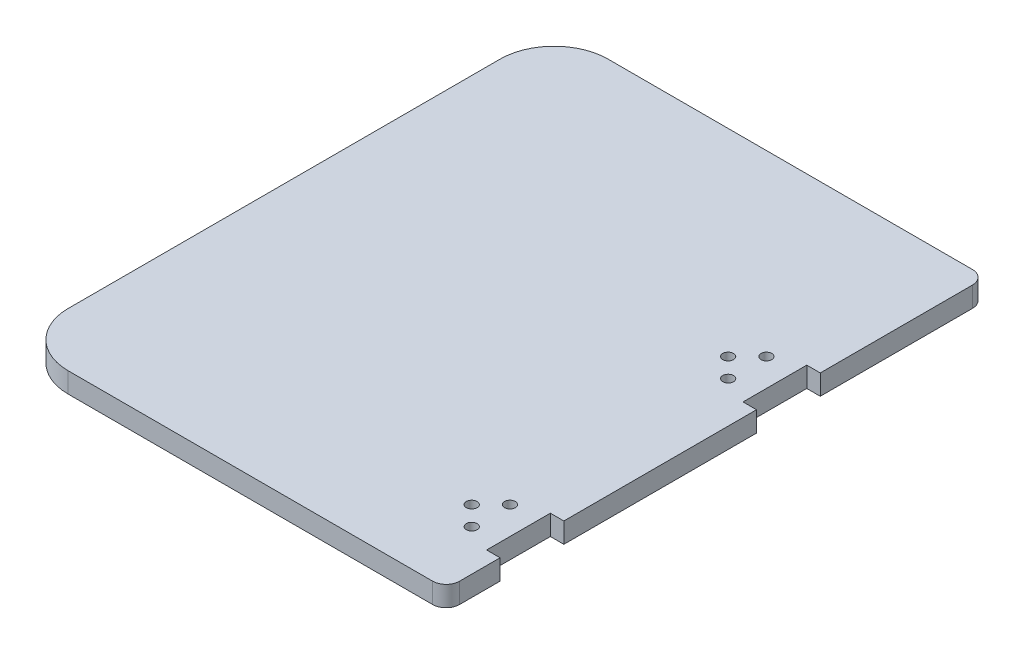
ISO-10303-21;
HEADER;
FILE_DESCRIPTION(('STEP AP214'),'2;1');
FILE_NAME('part.step','',(''),(''),'','','');
FILE_SCHEMA(('AUTOMOTIVE_DESIGN { 1 0 10303 214 1 1 1 1 }'));
ENDSEC;
DATA;
#1=APPLICATION_CONTEXT('core data for automotive mechanical design processes');
#2=APPLICATION_PROTOCOL_DEFINITION('international standard','automotive_design',2000,#1);
#3=PRODUCT_CONTEXT('',#1,'mechanical');
#4=PRODUCT('Part','Part','',(#3));
#5=PRODUCT_RELATED_PRODUCT_CATEGORY('part','',(#4));
#6=PRODUCT_DEFINITION_FORMATION('','',#4);
#7=PRODUCT_DEFINITION_CONTEXT('part definition',#1,'design');
#8=PRODUCT_DEFINITION('design','',#6,#7);
#9=PRODUCT_DEFINITION_SHAPE('','',#8);
#10=(LENGTH_UNIT() NAMED_UNIT(*) SI_UNIT(.MILLI.,.METRE.));
#11=(NAMED_UNIT(*) PLANE_ANGLE_UNIT() SI_UNIT($,.RADIAN.));
#12=(NAMED_UNIT(*) SI_UNIT($,.STERADIAN.) SOLID_ANGLE_UNIT());
#13=UNCERTAINTY_MEASURE_WITH_UNIT(LENGTH_MEASURE(1.E-05),#10,'distance_accuracy_value','');
#14=(GEOMETRIC_REPRESENTATION_CONTEXT(3) GLOBAL_UNCERTAINTY_ASSIGNED_CONTEXT((#13)) GLOBAL_UNIT_ASSIGNED_CONTEXT((#10,
#11,#12)) REPRESENTATION_CONTEXT('',''));
#15=CARTESIAN_POINT('',(0.,0.,0.));
#16=DIRECTION('',(0.,0.,1.));
#17=DIRECTION('',(1.,0.,0.));
#18=AXIS2_PLACEMENT_3D('',#15,#16,#17);
#19=CARTESIAN_POINT('',(203.2,9.525,-6.35000000000004));
#20=DIRECTION('',(-1.,0.,0.));
#21=DIRECTION('',(0.,0.,1.));
#22=AXIS2_PLACEMENT_3D('',#19,#20,#21);
#23=PLANE('',#22);
#24=DIRECTION('',(0.,0.,-1.));
#25=VECTOR('',#24,1.);
#26=CARTESIAN_POINT('',(203.2,9.525,-6.35000000000004));
#27=LINE('',#26,#25);
#28=CARTESIAN_POINT('',(203.2,9.525,-176.05));
#29=VERTEX_POINT('',#28);
#30=CARTESIAN_POINT('',(203.2,9.525,-247.65));
#31=VERTEX_POINT('',#30);
#32=EDGE_CURVE('E234',#29,#31,#27,.T.);
#33=ORIENTED_EDGE('',*,*,#32,.F.);
#34=DIRECTION('',(0.,1.,0.));
#35=VECTOR('',#34,1.);
#36=CARTESIAN_POINT('',(203.2,-0.000999999999999265,-176.05));
#37=LINE('',#36,#35);
#38=CARTESIAN_POINT('',(203.2,0.,-176.05));
#39=VERTEX_POINT('',#38);
#40=EDGE_CURVE('E184',#39,#29,#37,.T.);
#41=ORIENTED_EDGE('',*,*,#40,.F.);
#42=DIRECTION('',(0.,0.,-1.));
#43=VECTOR('',#42,1.);
#44=CARTESIAN_POINT('',(203.2,0.,-6.35000000000004));
#45=LINE('',#44,#43);
#46=CARTESIAN_POINT('',(203.2,0.,-247.65));
#47=VERTEX_POINT('',#46);
#48=EDGE_CURVE('E254',#39,#47,#45,.T.);
#49=ORIENTED_EDGE('',*,*,#48,.T.);
#50=DIRECTION('',(0.,-1.,0.));
#51=VECTOR('',#50,1.);
#52=CARTESIAN_POINT('',(203.2,9.525,-247.65));
#53=LINE('',#52,#51);
#54=EDGE_CURVE('E267',#31,#47,#53,.T.);
#55=ORIENTED_EDGE('',*,*,#54,.F.);
#56=EDGE_LOOP('',(#33,#41,#49,#55));
#57=FACE_BOUND('',#56,.T.);
#58=ADVANCED_FACE('F32',(#57),#23,.F.);
#59=CARTESIAN_POINT('',(203.2,0.,-55.4));
#60=VERTEX_POINT('',#59);
#61=CARTESIAN_POINT('',(203.2,0.,-146.05));
#62=VERTEX_POINT('',#61);
#63=EDGE_CURVE('E259',#60,#62,#45,.T.);
#64=ORIENTED_EDGE('',*,*,#63,.T.);
#65=DIRECTION('',(0.,1.,0.));
#66=VECTOR('',#65,1.);
#67=CARTESIAN_POINT('',(203.2,-0.000999999999999265,-146.05));
#68=LINE('',#67,#66);
#69=CARTESIAN_POINT('',(203.2,9.525,-146.05));
#70=VERTEX_POINT('',#69);
#71=EDGE_CURVE('E47',#62,#70,#68,.T.);
#72=ORIENTED_EDGE('',*,*,#71,.T.);
#73=CARTESIAN_POINT('',(203.2,9.525,-55.4));
#74=VERTEX_POINT('',#73);
#75=EDGE_CURVE('E239',#74,#70,#27,.T.);
#76=ORIENTED_EDGE('',*,*,#75,.F.);
#77=DIRECTION('',(0.,1.,0.));
#78=VECTOR('',#77,1.);
#79=CARTESIAN_POINT('',(203.2,-0.000999999999999265,-55.4));
#80=LINE('',#79,#78);
#81=EDGE_CURVE('E216',#60,#74,#80,.T.);
#82=ORIENTED_EDGE('',*,*,#81,.F.);
#83=EDGE_LOOP('',(#64,#72,#76,#82));
#84=FACE_BOUND('',#83,.T.);
#85=ADVANCED_FACE('F324',(#84),#23,.F.);
#86=CARTESIAN_POINT('',(25.4,9.525,-228.6));
#87=DIRECTION('',(0.,-1.,0.));
#88=DIRECTION('',(0.,0.,-1.));
#89=AXIS2_PLACEMENT_3D('',#86,#87,#88);
#90=CYLINDRICAL_SURFACE('',#89,25.4);
#91=CARTESIAN_POINT('',(25.4,0.,-228.6));
#92=DIRECTION('',(0.,1.,0.));
#93=DIRECTION('',(0.,0.,1.));
#94=AXIS2_PLACEMENT_3D('',#91,#92,#93);
#95=CIRCLE('',#94,25.4);
#96=CARTESIAN_POINT('',(25.4000000000002,0.,-254.));
#97=VERTEX_POINT('',#96);
#98=CARTESIAN_POINT('',(0.,0.,-228.6));
#99=VERTEX_POINT('',#98);
#100=EDGE_CURVE('E221',#97,#99,#95,.T.);
#101=ORIENTED_EDGE('',*,*,#100,.T.);
#102=DIRECTION('',(0.,-1.,0.));
#103=VECTOR('',#102,1.);
#104=CARTESIAN_POINT('',(0.,9.525,-228.6));
#105=LINE('',#104,#103);
#106=CARTESIAN_POINT('',(0.,9.525,-228.6));
#107=VERTEX_POINT('',#106);
#108=EDGE_CURVE('E11',#107,#99,#105,.T.);
#109=ORIENTED_EDGE('',*,*,#108,.F.);
#110=CARTESIAN_POINT('',(25.4,9.525,-228.6));
#111=DIRECTION('',(0.,1.,0.));
#112=DIRECTION('',(0.,0.,1.));
#113=AXIS2_PLACEMENT_3D('',#110,#111,#112);
#114=CIRCLE('',#113,25.4);
#115=CARTESIAN_POINT('',(25.4000000000002,9.525,-254.));
#116=VERTEX_POINT('',#115);
#117=EDGE_CURVE('E222',#116,#107,#114,.T.);
#118=ORIENTED_EDGE('',*,*,#117,.F.);
#119=DIRECTION('',(0.,-1.,0.));
#120=VECTOR('',#119,1.);
#121=CARTESIAN_POINT('',(25.4000000000002,9.525,-254.));
#122=LINE('',#121,#120);
#123=EDGE_CURVE('E243',#116,#97,#122,.T.);
#124=ORIENTED_EDGE('',*,*,#123,.T.);
#125=EDGE_LOOP('',(#101,#109,#118,#124));
#126=FACE_BOUND('',#125,.T.);
#127=ADVANCED_FACE('F34',(#126),#90,.T.);
#128=CARTESIAN_POINT('',(0.,9.525,-25.4000000000002));
#129=DIRECTION('',(1.,0.,0.));
#130=DIRECTION('',(0.,0.,-1.));
#131=AXIS2_PLACEMENT_3D('',#128,#129,#130);
#132=PLANE('',#131);
#133=DIRECTION('',(0.,0.,1.));
#134=VECTOR('',#133,1.);
#135=CARTESIAN_POINT('',(0.,0.,-25.4000000000002));
#136=LINE('',#135,#134);
#137=CARTESIAN_POINT('',(0.,0.,-25.4000000000002));
#138=VERTEX_POINT('',#137);
#139=EDGE_CURVE('E246',#99,#138,#136,.T.);
#140=ORIENTED_EDGE('',*,*,#139,.T.);
#141=DIRECTION('',(0.,-1.,0.));
#142=VECTOR('',#141,1.);
#143=CARTESIAN_POINT('',(0.,9.525,-25.4000000000002));
#144=LINE('',#143,#142);
#145=CARTESIAN_POINT('',(0.,9.525,-25.4000000000002));
#146=VERTEX_POINT('',#145);
#147=EDGE_CURVE('E40',#146,#138,#144,.T.);
#148=ORIENTED_EDGE('',*,*,#147,.F.);
#149=DIRECTION('',(0.,0.,1.));
#150=VECTOR('',#149,1.);
#151=CARTESIAN_POINT('',(0.,9.525,-25.4000000000002));
#152=LINE('',#151,#150);
#153=EDGE_CURVE('E225',#107,#146,#152,.T.);
#154=ORIENTED_EDGE('',*,*,#153,.F.);
#155=ORIENTED_EDGE('',*,*,#108,.T.);
#156=EDGE_LOOP('',(#140,#148,#154,#155));
#157=FACE_BOUND('',#156,.T.);
#158=ADVANCED_FACE('F306',(#157),#132,.F.);
#159=CARTESIAN_POINT('',(25.4,9.525,-25.4));
#160=DIRECTION('',(0.,-1.,0.));
#161=DIRECTION('',(0.,0.,-1.));
#162=AXIS2_PLACEMENT_3D('',#159,#160,#161);
#163=CYLINDRICAL_SURFACE('',#162,25.4);
#164=CARTESIAN_POINT('',(25.4,0.,-25.4));
#165=DIRECTION('',(0.,1.,0.));
#166=DIRECTION('',(0.,0.,-1.));
#167=AXIS2_PLACEMENT_3D('',#164,#165,#166);
#168=CIRCLE('',#167,25.4);
#169=CARTESIAN_POINT('',(25.4000000000002,0.,0.));
#170=VERTEX_POINT('',#169);
#171=EDGE_CURVE('E248',#138,#170,#168,.T.);
#172=ORIENTED_EDGE('',*,*,#171,.T.);
#173=DIRECTION('',(0.,-1.,0.));
#174=VECTOR('',#173,1.);
#175=CARTESIAN_POINT('',(25.4000000000002,9.525,0.));
#176=LINE('',#175,#174);
#177=CARTESIAN_POINT('',(25.4000000000002,9.525,0.));
#178=VERTEX_POINT('',#177);
#179=EDGE_CURVE('E276',#178,#170,#176,.T.);
#180=ORIENTED_EDGE('',*,*,#179,.F.);
#181=CARTESIAN_POINT('',(25.4,9.525,-25.4));
#182=DIRECTION('',(0.,1.,0.));
#183=DIRECTION('',(0.,0.,-1.));
#184=AXIS2_PLACEMENT_3D('',#181,#182,#183);
#185=CIRCLE('',#184,25.4);
#186=EDGE_CURVE('E228',#146,#178,#185,.T.);
#187=ORIENTED_EDGE('',*,*,#186,.F.);
#188=ORIENTED_EDGE('',*,*,#147,.T.);
#189=EDGE_LOOP('',(#172,#180,#187,#188));
#190=FACE_BOUND('',#189,.T.);
#191=ADVANCED_FACE('F283',(#190),#163,.T.);
#192=CARTESIAN_POINT('',(25.4000000000002,9.525,0.));
#193=DIRECTION('',(0.,0.,-1.));
#194=DIRECTION('',(-1.,0.,0.));
#195=AXIS2_PLACEMENT_3D('',#192,#193,#194);
#196=PLANE('',#195);
#197=DIRECTION('',(1.,0.,0.));
#198=VECTOR('',#197,1.);
#199=CARTESIAN_POINT('',(25.4000000000002,0.,0.));
#200=LINE('',#199,#198);
#201=CARTESIAN_POINT('',(196.85,0.,0.));
#202=VERTEX_POINT('',#201);
#203=EDGE_CURVE('E250',#170,#202,#200,.T.);
#204=ORIENTED_EDGE('',*,*,#203,.T.);
#205=DIRECTION('',(0.,-1.,0.));
#206=VECTOR('',#205,1.);
#207=CARTESIAN_POINT('',(196.85,9.525,0.));
#208=LINE('',#207,#206);
#209=CARTESIAN_POINT('',(196.85,9.525,0.));
#210=VERTEX_POINT('',#209);
#211=EDGE_CURVE('E273',#210,#202,#208,.T.);
#212=ORIENTED_EDGE('',*,*,#211,.F.);
#213=DIRECTION('',(1.,0.,0.));
#214=VECTOR('',#213,1.);
#215=CARTESIAN_POINT('',(25.4000000000002,9.525,0.));
#216=LINE('',#215,#214);
#217=EDGE_CURVE('E230',#178,#210,#216,.T.);
#218=ORIENTED_EDGE('',*,*,#217,.F.);
#219=ORIENTED_EDGE('',*,*,#179,.T.);
#220=EDGE_LOOP('',(#204,#212,#218,#219));
#221=FACE_BOUND('',#220,.T.);
#222=ADVANCED_FACE('F292',(#221),#196,.F.);
#223=CARTESIAN_POINT('',(196.85,9.525,-6.35));
#224=DIRECTION('',(0.,-1.,0.));
#225=DIRECTION('',(0.,0.,-1.));
#226=AXIS2_PLACEMENT_3D('',#223,#224,#225);
#227=CYLINDRICAL_SURFACE('',#226,6.35);
#228=CARTESIAN_POINT('',(196.85,0.,-6.35));
#229=DIRECTION('',(0.,1.,0.));
#230=DIRECTION('',(0.,0.,1.));
#231=AXIS2_PLACEMENT_3D('',#228,#229,#230);
#232=CIRCLE('',#231,6.35);
#233=CARTESIAN_POINT('',(203.2,0.,-6.35000000000004));
#234=VERTEX_POINT('',#233);
#235=EDGE_CURVE('E252',#202,#234,#232,.T.);
#236=ORIENTED_EDGE('',*,*,#235,.T.);
#237=DIRECTION('',(0.,-1.,0.));
#238=VECTOR('',#237,1.);
#239=CARTESIAN_POINT('',(203.2,9.525,-6.35000000000004));
#240=LINE('',#239,#238);
#241=CARTESIAN_POINT('',(203.2,9.525,-6.35000000000004));
#242=VERTEX_POINT('',#241);
#243=EDGE_CURVE('E270',#242,#234,#240,.T.);
#244=ORIENTED_EDGE('',*,*,#243,.F.);
#245=CARTESIAN_POINT('',(196.85,9.525,-6.35));
#246=DIRECTION('',(0.,1.,0.));
#247=DIRECTION('',(0.,0.,1.));
#248=AXIS2_PLACEMENT_3D('',#245,#246,#247);
#249=CIRCLE('',#248,6.35);
#250=EDGE_CURVE('E232',#210,#242,#249,.T.);
#251=ORIENTED_EDGE('',*,*,#250,.F.);
#252=ORIENTED_EDGE('',*,*,#211,.T.);
#253=EDGE_LOOP('',(#236,#244,#251,#252));
#254=FACE_BOUND('',#253,.T.);
#255=ADVANCED_FACE('F296',(#254),#227,.T.);
#256=CARTESIAN_POINT('',(203.2,0.,-25.4));
#257=VERTEX_POINT('',#256);
#258=EDGE_CURVE('E255',#234,#257,#45,.T.);
#259=ORIENTED_EDGE('',*,*,#258,.T.);
#260=DIRECTION('',(0.,1.,0.));
#261=VECTOR('',#260,1.);
#262=CARTESIAN_POINT('',(203.2,-0.000999999999999265,-25.4));
#263=LINE('',#262,#261);
#264=CARTESIAN_POINT('',(203.2,9.525,-25.4));
#265=VERTEX_POINT('',#264);
#266=EDGE_CURVE('E55',#257,#265,#263,.T.);
#267=ORIENTED_EDGE('',*,*,#266,.T.);
#268=EDGE_CURVE('E235',#242,#265,#27,.T.);
#269=ORIENTED_EDGE('',*,*,#268,.F.);
#270=ORIENTED_EDGE('',*,*,#243,.T.);
#271=EDGE_LOOP('',(#259,#267,#269,#270));
#272=FACE_BOUND('',#271,.T.);
#273=ADVANCED_FACE('F337',(#272),#23,.F.);
#274=CARTESIAN_POINT('',(196.85,9.525,-247.65));
#275=DIRECTION('',(0.,-1.,0.));
#276=DIRECTION('',(0.,0.,-1.));
#277=AXIS2_PLACEMENT_3D('',#274,#275,#276);
#278=CYLINDRICAL_SURFACE('',#277,6.34999999999999);
#279=CARTESIAN_POINT('',(196.85,0.,-247.65));
#280=DIRECTION('',(0.,1.,0.));
#281=DIRECTION('',(0.,0.,1.));
#282=AXIS2_PLACEMENT_3D('',#279,#280,#281);
#283=CIRCLE('',#282,6.34999999999999);
#284=CARTESIAN_POINT('',(196.85,0.,-254.));
#285=VERTEX_POINT('',#284);
#286=EDGE_CURVE('E258',#47,#285,#283,.T.);
#287=ORIENTED_EDGE('',*,*,#286,.T.);
#288=DIRECTION('',(0.,-1.,0.));
#289=VECTOR('',#288,1.);
#290=CARTESIAN_POINT('',(196.85,9.525,-254.));
#291=LINE('',#290,#289);
#292=CARTESIAN_POINT('',(196.85,9.525,-254.));
#293=VERTEX_POINT('',#292);
#294=EDGE_CURVE('E264',#293,#285,#291,.T.);
#295=ORIENTED_EDGE('',*,*,#294,.F.);
#296=CARTESIAN_POINT('',(196.85,9.525,-247.65));
#297=DIRECTION('',(0.,1.,0.));
#298=DIRECTION('',(0.,0.,1.));
#299=AXIS2_PLACEMENT_3D('',#296,#297,#298);
#300=CIRCLE('',#299,6.34999999999999);
#301=EDGE_CURVE('E238',#31,#293,#300,.T.);
#302=ORIENTED_EDGE('',*,*,#301,.F.);
#303=ORIENTED_EDGE('',*,*,#54,.T.);
#304=EDGE_LOOP('',(#287,#295,#302,#303));
#305=FACE_BOUND('',#304,.T.);
#306=ADVANCED_FACE('F317',(#305),#278,.T.);
#307=CARTESIAN_POINT('',(25.4000000000002,9.525,-254.));
#308=DIRECTION('',(0.,0.,1.));
#309=DIRECTION('',(1.,0.,0.));
#310=AXIS2_PLACEMENT_3D('',#307,#308,#309);
#311=PLANE('',#310);
#312=DIRECTION('',(-1.,0.,0.));
#313=VECTOR('',#312,1.);
#314=CARTESIAN_POINT('',(25.4000000000002,0.,-254.));
#315=LINE('',#314,#313);
#316=EDGE_CURVE('E226',#285,#97,#315,.T.);
#317=ORIENTED_EDGE('',*,*,#316,.T.);
#318=ORIENTED_EDGE('',*,*,#123,.F.);
#319=DIRECTION('',(-1.,0.,0.));
#320=VECTOR('',#319,1.);
#321=CARTESIAN_POINT('',(25.4000000000002,9.525,-254.));
#322=LINE('',#321,#320);
#323=EDGE_CURVE('E241',#293,#116,#322,.T.);
#324=ORIENTED_EDGE('',*,*,#323,.F.);
#325=ORIENTED_EDGE('',*,*,#294,.T.);
#326=EDGE_LOOP('',(#317,#318,#324,#325));
#327=FACE_BOUND('',#326,.T.);
#328=ADVANCED_FACE('F312',(#327),#311,.F.);
#329=CARTESIAN_POINT('',(25.4,9.525,-228.6));
#330=DIRECTION('',(0.,1.,0.));
#331=DIRECTION('',(0.,0.,1.));
#332=AXIS2_PLACEMENT_3D('',#329,#330,#331);
#333=PLANE('',#332);
#334=DIRECTION('',(-1.,0.,0.));
#335=VECTOR('',#334,1.);
#336=CARTESIAN_POINT('',(196.85,9.525,-176.05));
#337=LINE('',#336,#335);
#338=CARTESIAN_POINT('',(196.85,9.525,-176.05));
#339=VERTEX_POINT('',#338);
#340=EDGE_CURVE('E155',#29,#339,#337,.T.);
#341=ORIENTED_EDGE('',*,*,#340,.F.);
#342=ORIENTED_EDGE('',*,*,#32,.T.);
#343=ORIENTED_EDGE('',*,*,#301,.T.);
#344=ORIENTED_EDGE('',*,*,#323,.T.);
#345=ORIENTED_EDGE('',*,*,#117,.T.);
#346=ORIENTED_EDGE('',*,*,#153,.T.);
#347=ORIENTED_EDGE('',*,*,#186,.T.);
#348=ORIENTED_EDGE('',*,*,#217,.T.);
#349=ORIENTED_EDGE('',*,*,#250,.T.);
#350=ORIENTED_EDGE('',*,*,#268,.T.);
#351=DIRECTION('',(1.,0.,0.));
#352=VECTOR('',#351,1.);
#353=CARTESIAN_POINT('',(196.85,9.525,-25.4));
#354=LINE('',#353,#352);
#355=CARTESIAN_POINT('',(196.85,9.525,-25.4));
#356=VERTEX_POINT('',#355);
#357=EDGE_CURVE('E207',#356,#265,#354,.T.);
#358=ORIENTED_EDGE('',*,*,#357,.F.);
#359=DIRECTION('',(0.,0.,1.));
#360=VECTOR('',#359,1.);
#361=CARTESIAN_POINT('',(196.85,9.525,-55.4));
#362=LINE('',#361,#360);
#363=CARTESIAN_POINT('',(196.85,9.525,-55.4));
#364=VERTEX_POINT('',#363);
#365=EDGE_CURVE('E204',#364,#356,#362,.T.);
#366=ORIENTED_EDGE('',*,*,#365,.F.);
#367=DIRECTION('',(-1.,0.,0.));
#368=VECTOR('',#367,1.);
#369=CARTESIAN_POINT('',(196.85,9.525,-55.4));
#370=LINE('',#369,#368);
#371=EDGE_CURVE('E209',#74,#364,#370,.T.);
#372=ORIENTED_EDGE('',*,*,#371,.F.);
#373=ORIENTED_EDGE('',*,*,#75,.T.);
#374=DIRECTION('',(1.,0.,0.));
#375=VECTOR('',#374,1.);
#376=CARTESIAN_POINT('',(196.85,9.525,-146.05));
#377=LINE('',#376,#375);
#378=CARTESIAN_POINT('',(196.85,9.525,-146.05));
#379=VERTEX_POINT('',#378);
#380=EDGE_CURVE('E179',#379,#70,#377,.T.);
#381=ORIENTED_EDGE('',*,*,#380,.F.);
#382=DIRECTION('',(0.,0.,1.));
#383=VECTOR('',#382,1.);
#384=CARTESIAN_POINT('',(196.85,9.525,-176.05));
#385=LINE('',#384,#383);
#386=EDGE_CURVE('E153',#339,#379,#385,.T.);
#387=ORIENTED_EDGE('',*,*,#386,.F.);
#388=EDGE_LOOP('',(#341,#342,#343,#344,#345,#346,#347,#348,#349,#350,#358,#366,#372,#373,#381,#387));
#389=FACE_BOUND('',#388,.T.);
#390=CARTESIAN_POINT('',(183.8500006,9.525,-31.40000022));
#391=DIRECTION('',(0.,1.,0.));
#392=DIRECTION('',(0.,0.,-1.));
#393=AXIS2_PLACEMENT_3D('',#390,#391,#392);
#394=CIRCLE('',#393,2.54000000000001);
#395=CARTESIAN_POINT('',(183.8500006,9.525,-33.94000022));
#396=VERTEX_POINT('',#395);
#397=EDGE_CURVE('E162',#396,#396,#394,.T.);
#398=ORIENTED_EDGE('',*,*,#397,.F.);
#399=EDGE_LOOP('',(#398));
#400=FACE_BOUND('',#399,.T.);
#401=CARTESIAN_POINT('',(183.8500006,9.525,-49.39999978));
#402=DIRECTION('',(0.,1.,0.));
#403=DIRECTION('',(0.,0.,1.));
#404=AXIS2_PLACEMENT_3D('',#401,#402,#403);
#405=CIRCLE('',#404,2.54000000000001);
#406=CARTESIAN_POINT('',(183.8500006,9.525,-46.85999978));
#407=VERTEX_POINT('',#406);
#408=EDGE_CURVE('E195',#407,#407,#405,.T.);
#409=ORIENTED_EDGE('',*,*,#408,.F.);
#410=EDGE_LOOP('',(#409));
#411=FACE_BOUND('',#410,.T.);
#412=CARTESIAN_POINT('',(174.85000082,9.525,-40.4));
#413=DIRECTION('',(0.,1.,0.));
#414=DIRECTION('',(0.,0.,1.));
#415=AXIS2_PLACEMENT_3D('',#412,#413,#414);
#416=CIRCLE('',#415,2.54000000000001);
#417=CARTESIAN_POINT('',(174.85000082,9.525,-37.86));
#418=VERTEX_POINT('',#417);
#419=EDGE_CURVE('E187',#418,#418,#416,.T.);
#420=ORIENTED_EDGE('',*,*,#419,.F.);
#421=EDGE_LOOP('',(#420));
#422=FACE_BOUND('',#421,.T.);
#423=CARTESIAN_POINT('',(174.85000082,9.525,-161.05));
#424=DIRECTION('',(0.,1.,0.));
#425=DIRECTION('',(0.,0.,1.));
#426=AXIS2_PLACEMENT_3D('',#423,#424,#425);
#427=CIRCLE('',#426,2.54000000000001);
#428=CARTESIAN_POINT('',(174.85000082,9.525,-158.51));
#429=VERTEX_POINT('',#428);
#430=EDGE_CURVE('E172',#429,#429,#427,.T.);
#431=ORIENTED_EDGE('',*,*,#430,.F.);
#432=EDGE_LOOP('',(#431));
#433=FACE_BOUND('',#432,.T.);
#434=CARTESIAN_POINT('',(183.8500006,9.525,-170.04999978));
#435=DIRECTION('',(0.,1.,0.));
#436=DIRECTION('',(0.,0.,1.));
#437=AXIS2_PLACEMENT_3D('',#434,#435,#436);
#438=CIRCLE('',#437,2.54);
#439=CARTESIAN_POINT('',(183.8500006,9.525,-167.50999978));
#440=VERTEX_POINT('',#439);
#441=EDGE_CURVE('E536',#440,#440,#438,.T.);
#442=ORIENTED_EDGE('',*,*,#441,.F.);
#443=EDGE_LOOP('',(#442));
#444=FACE_BOUND('',#443,.T.);
#445=CARTESIAN_POINT('',(183.8500006,9.525,-152.05000022));
#446=DIRECTION('',(0.,1.,0.));
#447=DIRECTION('',(0.,0.,-1.));
#448=AXIS2_PLACEMENT_3D('',#445,#446,#447);
#449=CIRCLE('',#448,2.54000000000001);
#450=CARTESIAN_POINT('',(183.8500006,9.525,-154.59000022));
#451=VERTEX_POINT('',#450);
#452=EDGE_CURVE('E537',#451,#451,#449,.T.);
#453=ORIENTED_EDGE('',*,*,#452,.F.);
#454=EDGE_LOOP('',(#453));
#455=FACE_BOUND('',#454,.T.);
#456=ADVANCED_FACE('F301',(#389,#400,#411,#422,#433,#444,#455),#333,.T.);
#457=CARTESIAN_POINT('',(25.4,0.,-228.6));
#458=DIRECTION('',(0.,1.,0.));
#459=DIRECTION('',(0.,0.,1.));
#460=AXIS2_PLACEMENT_3D('',#457,#458,#459);
#461=PLANE('',#460);
#462=CARTESIAN_POINT('',(183.8500006,0.,-31.40000022));
#463=DIRECTION('',(0.,1.,0.));
#464=DIRECTION('',(0.,0.,1.));
#465=AXIS2_PLACEMENT_3D('',#462,#463,#464);
#466=CIRCLE('',#465,2.54000000000001);
#467=CARTESIAN_POINT('',(183.8500006,0.,-28.86000022));
#468=VERTEX_POINT('',#467);
#469=EDGE_CURVE('E175',#468,#468,#466,.F.);
#470=ORIENTED_EDGE('',*,*,#469,.F.);
#471=EDGE_LOOP('',(#470));
#472=FACE_BOUND('',#471,.T.);
#473=CARTESIAN_POINT('',(183.8500006,0.,-49.39999978));
#474=DIRECTION('',(0.,1.,0.));
#475=DIRECTION('',(0.,0.,1.));
#476=AXIS2_PLACEMENT_3D('',#473,#474,#475);
#477=CIRCLE('',#476,2.54000000000001);
#478=CARTESIAN_POINT('',(183.8500006,0.,-46.85999978));
#479=VERTEX_POINT('',#478);
#480=EDGE_CURVE('E191',#479,#479,#477,.F.);
#481=ORIENTED_EDGE('',*,*,#480,.F.);
#482=EDGE_LOOP('',(#481));
#483=FACE_BOUND('',#482,.T.);
#484=CARTESIAN_POINT('',(174.85000082,0.,-40.4));
#485=DIRECTION('',(0.,1.,0.));
#486=DIRECTION('',(0.,0.,1.));
#487=AXIS2_PLACEMENT_3D('',#484,#485,#486);
#488=CIRCLE('',#487,2.54000000000001);
#489=CARTESIAN_POINT('',(174.85000082,0.,-37.86));
#490=VERTEX_POINT('',#489);
#491=EDGE_CURVE('E190',#490,#490,#488,.F.);
#492=ORIENTED_EDGE('',*,*,#491,.F.);
#493=EDGE_LOOP('',(#492));
#494=FACE_BOUND('',#493,.T.);
#495=CARTESIAN_POINT('',(174.85000082,0.,-161.05));
#496=DIRECTION('',(0.,1.,0.));
#497=DIRECTION('',(0.,0.,1.));
#498=AXIS2_PLACEMENT_3D('',#495,#496,#497);
#499=CIRCLE('',#498,2.54000000000001);
#500=CARTESIAN_POINT('',(174.85000082,0.,-158.51));
#501=VERTEX_POINT('',#500);
#502=EDGE_CURVE('E168',#501,#501,#499,.F.);
#503=ORIENTED_EDGE('',*,*,#502,.F.);
#504=EDGE_LOOP('',(#503));
#505=FACE_BOUND('',#504,.T.);
#506=CARTESIAN_POINT('',(183.8500006,0.,-170.04999978));
#507=DIRECTION('',(0.,1.,0.));
#508=DIRECTION('',(0.,0.,1.));
#509=AXIS2_PLACEMENT_3D('',#506,#507,#508);
#510=CIRCLE('',#509,2.54);
#511=CARTESIAN_POINT('',(183.8500006,0.,-167.50999978));
#512=VERTEX_POINT('',#511);
#513=EDGE_CURVE('E540',#512,#512,#510,.F.);
#514=ORIENTED_EDGE('',*,*,#513,.F.);
#515=EDGE_LOOP('',(#514));
#516=FACE_BOUND('',#515,.T.);
#517=CARTESIAN_POINT('',(183.8500006,0.,-152.05000022));
#518=DIRECTION('',(0.,1.,0.));
#519=DIRECTION('',(0.,0.,1.));
#520=AXIS2_PLACEMENT_3D('',#517,#518,#519);
#521=CIRCLE('',#520,2.54000000000001);
#522=CARTESIAN_POINT('',(183.8500006,0.,-149.51000022));
#523=VERTEX_POINT('',#522);
#524=EDGE_CURVE('E533',#523,#523,#521,.F.);
#525=ORIENTED_EDGE('',*,*,#524,.F.);
#526=EDGE_LOOP('',(#525));
#527=FACE_BOUND('',#526,.T.);
#528=ORIENTED_EDGE('',*,*,#48,.F.);
#529=DIRECTION('',(1.,0.,0.));
#530=VECTOR('',#529,1.);
#531=CARTESIAN_POINT('',(196.85,0.,-176.05));
#532=LINE('',#531,#530);
#533=CARTESIAN_POINT('',(196.85,0.,-176.05));
#534=VERTEX_POINT('',#533);
#535=EDGE_CURVE('E167',#534,#39,#532,.T.);
#536=ORIENTED_EDGE('',*,*,#535,.F.);
#537=DIRECTION('',(0.,0.,-1.));
#538=VECTOR('',#537,1.);
#539=CARTESIAN_POINT('',(196.85,0.,-176.05));
#540=LINE('',#539,#538);
#541=CARTESIAN_POINT('',(196.85,0.,-146.05));
#542=VERTEX_POINT('',#541);
#543=EDGE_CURVE('E150',#542,#534,#540,.T.);
#544=ORIENTED_EDGE('',*,*,#543,.F.);
#545=DIRECTION('',(-1.,0.,0.));
#546=VECTOR('',#545,1.);
#547=CARTESIAN_POINT('',(196.85,0.,-146.05));
#548=LINE('',#547,#546);
#549=EDGE_CURVE('E157',#62,#542,#548,.T.);
#550=ORIENTED_EDGE('',*,*,#549,.F.);
#551=ORIENTED_EDGE('',*,*,#63,.F.);
#552=DIRECTION('',(1.,0.,0.));
#553=VECTOR('',#552,1.);
#554=CARTESIAN_POINT('',(196.85,0.,-55.4));
#555=LINE('',#554,#553);
#556=CARTESIAN_POINT('',(196.85,0.,-55.4));
#557=VERTEX_POINT('',#556);
#558=EDGE_CURVE('E202',#557,#60,#555,.T.);
#559=ORIENTED_EDGE('',*,*,#558,.F.);
#560=DIRECTION('',(0.,0.,-1.));
#561=VECTOR('',#560,1.);
#562=CARTESIAN_POINT('',(196.85,0.,-55.4));
#563=LINE('',#562,#561);
#564=CARTESIAN_POINT('',(196.85,0.,-25.4));
#565=VERTEX_POINT('',#564);
#566=EDGE_CURVE('E194',#565,#557,#563,.T.);
#567=ORIENTED_EDGE('',*,*,#566,.F.);
#568=DIRECTION('',(-1.,0.,0.));
#569=VECTOR('',#568,1.);
#570=CARTESIAN_POINT('',(196.85,0.,-25.4));
#571=LINE('',#570,#569);
#572=EDGE_CURVE('E215',#257,#565,#571,.T.);
#573=ORIENTED_EDGE('',*,*,#572,.F.);
#574=ORIENTED_EDGE('',*,*,#258,.F.);
#575=ORIENTED_EDGE('',*,*,#235,.F.);
#576=ORIENTED_EDGE('',*,*,#203,.F.);
#577=ORIENTED_EDGE('',*,*,#171,.F.);
#578=ORIENTED_EDGE('',*,*,#139,.F.);
#579=ORIENTED_EDGE('',*,*,#100,.F.);
#580=ORIENTED_EDGE('',*,*,#316,.F.);
#581=ORIENTED_EDGE('',*,*,#286,.F.);
#582=EDGE_LOOP('',(#528,#536,#544,#550,#551,#559,#567,#573,#574,#575,#576,#577,#578,#579,#580,#581));
#583=FACE_BOUND('',#582,.T.);
#584=ADVANCED_FACE('F166',(#472,#483,#494,#505,#516,#527,#583),#461,.F.);
#585=CARTESIAN_POINT('',(196.85,-0.000999999999999265,-55.4));
#586=DIRECTION('',(-1.,0.,0.));
#587=DIRECTION('',(0.,0.,1.));
#588=AXIS2_PLACEMENT_3D('',#585,#586,#587);
#589=PLANE('',#588);
#590=ORIENTED_EDGE('',*,*,#566,.T.);
#591=DIRECTION('',(0.,1.,0.));
#592=VECTOR('',#591,1.);
#593=CARTESIAN_POINT('',(196.85,-0.000999999999999265,-55.4));
#594=LINE('',#593,#592);
#595=EDGE_CURVE('E213',#557,#364,#594,.T.);
#596=ORIENTED_EDGE('',*,*,#595,.T.);
#597=ORIENTED_EDGE('',*,*,#365,.T.);
#598=DIRECTION('',(0.,1.,0.));
#599=VECTOR('',#598,1.);
#600=CARTESIAN_POINT('',(196.85,-0.000999999999999265,-25.4));
#601=LINE('',#600,#599);
#602=EDGE_CURVE('E212',#565,#356,#601,.T.);
#603=ORIENTED_EDGE('',*,*,#602,.F.);
#604=EDGE_LOOP('',(#590,#596,#597,#603));
#605=FACE_BOUND('',#604,.T.);
#606=ADVANCED_FACE('F334',(#605),#589,.F.);
#607=CARTESIAN_POINT('',(196.85,-0.000999999999999265,-55.4));
#608=DIRECTION('',(0.,0.,-1.));
#609=DIRECTION('',(-1.,0.,0.));
#610=AXIS2_PLACEMENT_3D('',#607,#608,#609);
#611=PLANE('',#610);
#612=ORIENTED_EDGE('',*,*,#558,.T.);
#613=ORIENTED_EDGE('',*,*,#81,.T.);
#614=ORIENTED_EDGE('',*,*,#371,.T.);
#615=ORIENTED_EDGE('',*,*,#595,.F.);
#616=EDGE_LOOP('',(#612,#613,#614,#615));
#617=FACE_BOUND('',#616,.T.);
#618=ADVANCED_FACE('F330',(#617),#611,.F.);
#619=CARTESIAN_POINT('',(196.85,-0.000999999999999265,-25.4));
#620=DIRECTION('',(0.,0.,1.));
#621=DIRECTION('',(1.,0.,0.));
#622=AXIS2_PLACEMENT_3D('',#619,#620,#621);
#623=PLANE('',#622);
#624=ORIENTED_EDGE('',*,*,#572,.T.);
#625=ORIENTED_EDGE('',*,*,#602,.T.);
#626=ORIENTED_EDGE('',*,*,#357,.T.);
#627=ORIENTED_EDGE('',*,*,#266,.F.);
#628=EDGE_LOOP('',(#624,#625,#626,#627));
#629=FACE_BOUND('',#628,.T.);
#630=ADVANCED_FACE('F335',(#629),#623,.F.);
#631=CARTESIAN_POINT('',(183.8500006,-0.000999999999999265,-152.05000022));
#632=DIRECTION('',(0.,1.,0.));
#633=DIRECTION('',(0.,0.,1.));
#634=AXIS2_PLACEMENT_3D('',#631,#632,#633);
#635=CYLINDRICAL_SURFACE('',#634,2.54000000000001);
#636=ORIENTED_EDGE('',*,*,#452,.T.);
#637=EDGE_LOOP('',(#636));
#638=FACE_BOUND('',#637,.T.);
#639=ORIENTED_EDGE('',*,*,#524,.T.);
#640=EDGE_LOOP('',(#639));
#641=FACE_BOUND('',#640,.T.);
#642=ADVANCED_FACE('F438',(#638,#641),#635,.F.);
#643=CARTESIAN_POINT('',(183.8500006,-0.000999999999999265,-170.04999978));
#644=DIRECTION('',(0.,1.,0.));
#645=DIRECTION('',(0.,0.,1.));
#646=AXIS2_PLACEMENT_3D('',#643,#644,#645);
#647=CYLINDRICAL_SURFACE('',#646,2.54);
#648=ORIENTED_EDGE('',*,*,#441,.T.);
#649=EDGE_LOOP('',(#648));
#650=FACE_BOUND('',#649,.T.);
#651=ORIENTED_EDGE('',*,*,#513,.T.);
#652=EDGE_LOOP('',(#651));
#653=FACE_BOUND('',#652,.T.);
#654=ADVANCED_FACE('F447',(#650,#653),#647,.F.);
#655=CARTESIAN_POINT('',(174.85000082,-0.000999999999999265,-161.05));
#656=DIRECTION('',(0.,1.,0.));
#657=DIRECTION('',(0.,0.,1.));
#658=AXIS2_PLACEMENT_3D('',#655,#656,#657);
#659=CYLINDRICAL_SURFACE('',#658,2.54000000000001);
#660=ORIENTED_EDGE('',*,*,#430,.T.);
#661=EDGE_LOOP('',(#660));
#662=FACE_BOUND('',#661,.T.);
#663=ORIENTED_EDGE('',*,*,#502,.T.);
#664=EDGE_LOOP('',(#663));
#665=FACE_BOUND('',#664,.T.);
#666=ADVANCED_FACE('F457',(#662,#665),#659,.F.);
#667=CARTESIAN_POINT('',(174.85000082,-0.000999999999999265,-40.4));
#668=DIRECTION('',(0.,1.,0.));
#669=DIRECTION('',(0.,0.,1.));
#670=AXIS2_PLACEMENT_3D('',#667,#668,#669);
#671=CYLINDRICAL_SURFACE('',#670,2.54000000000001);
#672=ORIENTED_EDGE('',*,*,#419,.T.);
#673=EDGE_LOOP('',(#672));
#674=FACE_BOUND('',#673,.T.);
#675=ORIENTED_EDGE('',*,*,#491,.T.);
#676=EDGE_LOOP('',(#675));
#677=FACE_BOUND('',#676,.T.);
#678=ADVANCED_FACE('F467',(#674,#677),#671,.F.);
#679=CARTESIAN_POINT('',(183.8500006,-0.000999999999999265,-49.39999978));
#680=DIRECTION('',(0.,1.,0.));
#681=DIRECTION('',(0.,0.,1.));
#682=AXIS2_PLACEMENT_3D('',#679,#680,#681);
#683=CYLINDRICAL_SURFACE('',#682,2.54000000000001);
#684=ORIENTED_EDGE('',*,*,#408,.T.);
#685=EDGE_LOOP('',(#684));
#686=FACE_BOUND('',#685,.T.);
#687=ORIENTED_EDGE('',*,*,#480,.T.);
#688=EDGE_LOOP('',(#687));
#689=FACE_BOUND('',#688,.T.);
#690=ADVANCED_FACE('F477',(#686,#689),#683,.F.);
#691=CARTESIAN_POINT('',(183.8500006,-0.000999999999999265,-31.40000022));
#692=DIRECTION('',(0.,1.,0.));
#693=DIRECTION('',(0.,0.,1.));
#694=AXIS2_PLACEMENT_3D('',#691,#692,#693);
#695=CYLINDRICAL_SURFACE('',#694,2.54000000000001);
#696=ORIENTED_EDGE('',*,*,#397,.T.);
#697=EDGE_LOOP('',(#696));
#698=FACE_BOUND('',#697,.T.);
#699=ORIENTED_EDGE('',*,*,#469,.T.);
#700=EDGE_LOOP('',(#699));
#701=FACE_BOUND('',#700,.T.);
#702=ADVANCED_FACE('F487',(#698,#701),#695,.F.);
#703=CARTESIAN_POINT('',(196.85,-0.000999999999999265,-176.05));
#704=DIRECTION('',(-1.,0.,0.));
#705=DIRECTION('',(0.,0.,1.));
#706=AXIS2_PLACEMENT_3D('',#703,#704,#705);
#707=PLANE('',#706);
#708=ORIENTED_EDGE('',*,*,#543,.T.);
#709=DIRECTION('',(0.,1.,0.));
#710=VECTOR('',#709,1.);
#711=CARTESIAN_POINT('',(196.85,-0.000999999999999265,-176.05));
#712=LINE('',#711,#710);
#713=EDGE_CURVE('E163',#534,#339,#712,.T.);
#714=ORIENTED_EDGE('',*,*,#713,.T.);
#715=ORIENTED_EDGE('',*,*,#386,.T.);
#716=DIRECTION('',(0.,1.,0.));
#717=VECTOR('',#716,1.);
#718=CARTESIAN_POINT('',(196.85,-0.000999999999999265,-146.05));
#719=LINE('',#718,#717);
#720=EDGE_CURVE('E147',#542,#379,#719,.T.);
#721=ORIENTED_EDGE('',*,*,#720,.F.);
#722=EDGE_LOOP('',(#708,#714,#715,#721));
#723=FACE_BOUND('',#722,.T.);
#724=ADVANCED_FACE('F148',(#723),#707,.F.);
#725=CARTESIAN_POINT('',(196.85,-0.000999999999999265,-176.05));
#726=DIRECTION('',(0.,0.,-1.));
#727=DIRECTION('',(-1.,0.,0.));
#728=AXIS2_PLACEMENT_3D('',#725,#726,#727);
#729=PLANE('',#728);
#730=ORIENTED_EDGE('',*,*,#535,.T.);
#731=ORIENTED_EDGE('',*,*,#40,.T.);
#732=ORIENTED_EDGE('',*,*,#340,.T.);
#733=ORIENTED_EDGE('',*,*,#713,.F.);
#734=EDGE_LOOP('',(#730,#731,#732,#733));
#735=FACE_BOUND('',#734,.T.);
#736=ADVANCED_FACE('F506',(#735),#729,.F.);
#737=CARTESIAN_POINT('',(196.85,-0.000999999999999265,-146.05));
#738=DIRECTION('',(0.,0.,1.));
#739=DIRECTION('',(1.,0.,0.));
#740=AXIS2_PLACEMENT_3D('',#737,#738,#739);
#741=PLANE('',#740);
#742=ORIENTED_EDGE('',*,*,#549,.T.);
#743=ORIENTED_EDGE('',*,*,#720,.T.);
#744=ORIENTED_EDGE('',*,*,#380,.T.);
#745=ORIENTED_EDGE('',*,*,#71,.F.);
#746=EDGE_LOOP('',(#742,#743,#744,#745));
#747=FACE_BOUND('',#746,.T.);
#748=ADVANCED_FACE('F158',(#747),#741,.F.);
#749=CLOSED_SHELL('',(#58,#85,#127,#158,#191,#222,#255,#273,#306,#328,#456,#584,#606,#618,#630,
#642,#654,#666,#678,#690,#702,#724,#736,#748));
#750=MANIFOLD_SOLID_BREP('B2',#749);
#751=ADVANCED_BREP_SHAPE_REPRESENTATION('',(#18,#750),#14);
#752=SHAPE_DEFINITION_REPRESENTATION(#9,#751);
ENDSEC;
END-ISO-10303-21;
